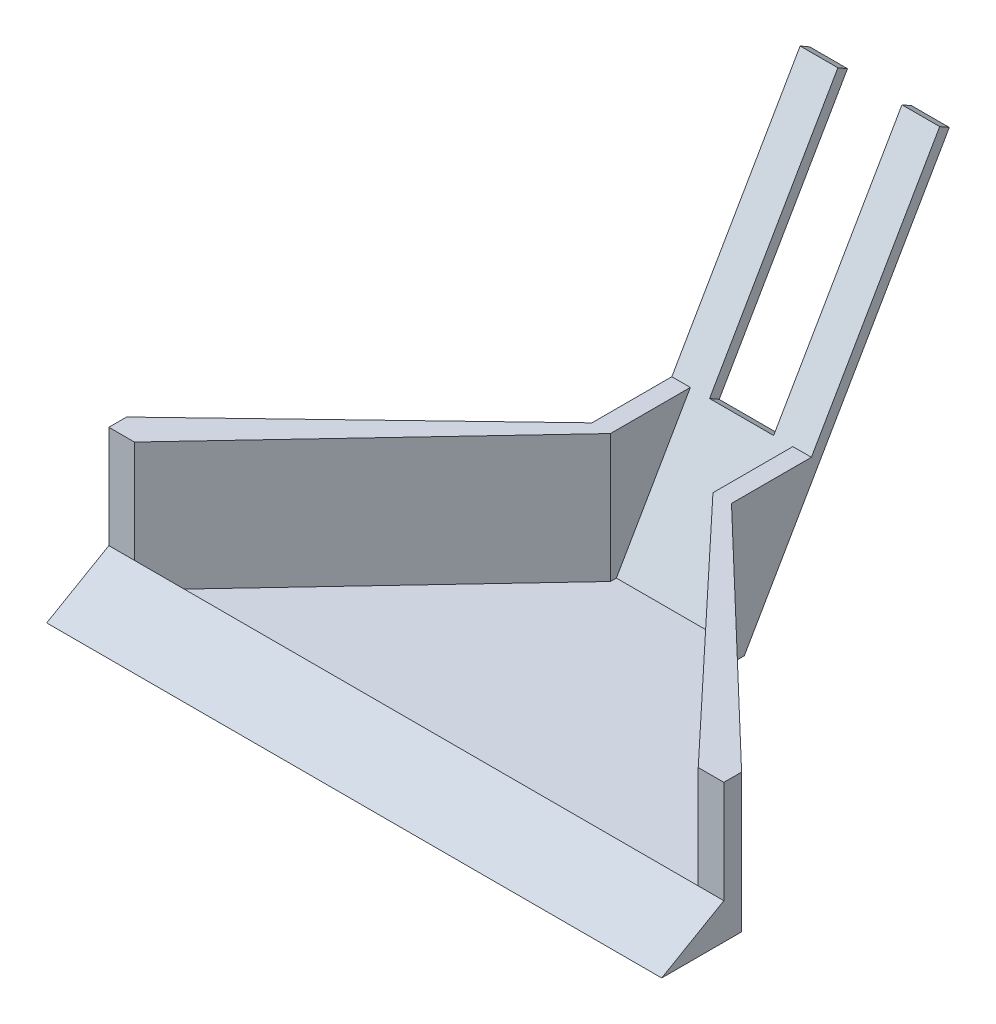
ISO-10303-21;
HEADER;
FILE_DESCRIPTION(('STEP AP214'),'2;1');
FILE_NAME('part.step','',(''),(''),'','','');
FILE_SCHEMA(('AUTOMOTIVE_DESIGN { 1 0 10303 214 1 1 1 1 }'));
ENDSEC;
DATA;
#1=APPLICATION_CONTEXT('core data for automotive mechanical design processes');
#2=APPLICATION_PROTOCOL_DEFINITION('international standard','automotive_design',2000,#1);
#3=PRODUCT_CONTEXT('',#1,'mechanical');
#4=PRODUCT('Part','Part','',(#3));
#5=PRODUCT_RELATED_PRODUCT_CATEGORY('part','',(#4));
#6=PRODUCT_DEFINITION_FORMATION('','',#4);
#7=PRODUCT_DEFINITION_CONTEXT('part definition',#1,'design');
#8=PRODUCT_DEFINITION('design','',#6,#7);
#9=PRODUCT_DEFINITION_SHAPE('','',#8);
#10=(LENGTH_UNIT() NAMED_UNIT(*) SI_UNIT(.MILLI.,.METRE.));
#11=(NAMED_UNIT(*) PLANE_ANGLE_UNIT() SI_UNIT($,.RADIAN.));
#12=(NAMED_UNIT(*) SI_UNIT($,.STERADIAN.) SOLID_ANGLE_UNIT());
#13=UNCERTAINTY_MEASURE_WITH_UNIT(LENGTH_MEASURE(1.E-05),#10,'distance_accuracy_value','');
#14=(GEOMETRIC_REPRESENTATION_CONTEXT(3) GLOBAL_UNCERTAINTY_ASSIGNED_CONTEXT((#13)) GLOBAL_UNIT_ASSIGNED_CONTEXT((#10,
#11,#12)) REPRESENTATION_CONTEXT('',''));
#15=CARTESIAN_POINT('',(0.,0.,0.));
#16=DIRECTION('',(0.,0.,1.));
#17=DIRECTION('',(1.,0.,0.));
#18=AXIS2_PLACEMENT_3D('',#15,#16,#17);
#19=CARTESIAN_POINT('',(0.,0.,152.4));
#20=DIRECTION('',(0.,1.,0.));
#21=DIRECTION('',(0.,0.,1.));
#22=AXIS2_PLACEMENT_3D('',#19,#20,#21);
#23=PLANE('',#22);
#24=DIRECTION('',(1.,0.,0.));
#25=VECTOR('',#24,1.);
#26=CARTESIAN_POINT('',(117.8183443338,0.,-6.35000000000004));
#27=LINE('',#26,#25);
#28=CARTESIAN_POINT('',(117.8183443338,0.,-6.35000000000001));
#29=VERTEX_POINT('',#28);
#30=CARTESIAN_POINT('',(186.9816556662,0.,-6.35));
#31=VERTEX_POINT('',#30);
#32=EDGE_CURVE('E212',#29,#31,#27,.T.);
#33=ORIENTED_EDGE('',*,*,#32,.T.);
#34=DIRECTION('',(0.,0.,1.));
#35=VECTOR('',#34,1.);
#36=CARTESIAN_POINT('',(186.9816556662,0.,-76.2));
#37=LINE('',#36,#35);
#38=CARTESIAN_POINT('',(186.9816556662,0.,0.));
#39=VERTEX_POINT('',#38);
#40=EDGE_CURVE('E233',#31,#39,#37,.T.);
#41=ORIENTED_EDGE('',*,*,#40,.T.);
#42=DIRECTION('',(0.72228416861206,0.,0.69159639947905));
#43=VECTOR('',#42,1.);
#44=CARTESIAN_POINT('',(165.562608695136,0.,-20.5090135007743));
#45=LINE('',#44,#43);
#46=CARTESIAN_POINT('',(304.8,0.,112.81258301759));
#47=VERTEX_POINT('',#46);
#48=EDGE_CURVE('E286',#39,#47,#45,.T.);
#49=ORIENTED_EDGE('',*,*,#48,.T.);
#50=DIRECTION('',(0.,0.,-1.));
#51=VECTOR('',#50,1.);
#52=CARTESIAN_POINT('',(304.8,0.,152.4));
#53=LINE('',#52,#51);
#54=CARTESIAN_POINT('',(304.8,0.,152.4));
#55=VERTEX_POINT('',#54);
#56=EDGE_CURVE('E313',#55,#47,#53,.T.);
#57=ORIENTED_EDGE('',*,*,#56,.F.);
#58=DIRECTION('',(1.,0.,0.));
#59=VECTOR('',#58,1.);
#60=CARTESIAN_POINT('',(0.,0.,152.4));
#61=LINE('',#60,#59);
#62=CARTESIAN_POINT('',(0.,0.,152.4));
#63=VERTEX_POINT('',#62);
#64=EDGE_CURVE('E310',#63,#55,#61,.T.);
#65=ORIENTED_EDGE('',*,*,#64,.F.);
#66=DIRECTION('',(0.,0.,-1.));
#67=VECTOR('',#66,1.);
#68=CARTESIAN_POINT('',(0.,0.,152.4));
#69=LINE('',#68,#67);
#70=CARTESIAN_POINT('',(0.,0.,112.812583017591));
#71=VERTEX_POINT('',#70);
#72=EDGE_CURVE('E316',#63,#71,#69,.T.);
#73=ORIENTED_EDGE('',*,*,#72,.T.);
#74=DIRECTION('',(0.72228416861206,0.,-0.69159639947905));
#75=VECTOR('',#74,1.);
#76=CARTESIAN_POINT('',(-19.7750679805127,0.,131.747465449053));
#77=LINE('',#76,#75);
#78=CARTESIAN_POINT('',(117.8183443338,0.,0.));
#79=VERTEX_POINT('',#78);
#80=EDGE_CURVE('E295',#71,#79,#77,.T.);
#81=ORIENTED_EDGE('',*,*,#80,.T.);
#82=DIRECTION('',(0.,0.,1.));
#83=VECTOR('',#82,1.);
#84=CARTESIAN_POINT('',(117.8183443338,0.,-76.2));
#85=LINE('',#84,#83);
#86=EDGE_CURVE('E231',#29,#79,#85,.T.);
#87=ORIENTED_EDGE('',*,*,#86,.F.);
#88=EDGE_LOOP('',(#33,#41,#49,#57,#65,#73,#81,#87));
#89=FACE_BOUND('',#88,.T.);
#90=ADVANCED_FACE('F32',(#89),#23,.F.);
#91=CARTESIAN_POINT('',(186.9816556662,68.58,-76.2));
#92=DIRECTION('',(-1.,0.,0.));
#93=DIRECTION('',(0.,-1.,0.));
#94=AXIS2_PLACEMENT_3D('',#91,#92,#93);
#95=PLANE('',#94);
#96=DIRECTION('',(0.,0.866025403784436,-0.500000000000004));
#97=VECTOR('',#96,1.);
#98=CARTESIAN_POINT('',(186.9816556662,0.,-6.35000000000002));
#99=LINE('',#98,#97);
#100=CARTESIAN_POINT('',(186.981655666199,175.976362048997,-107.950000000001));
#101=VERTEX_POINT('',#100);
#102=EDGE_CURVE('E206',#31,#101,#99,.T.);
#103=ORIENTED_EDGE('',*,*,#102,.T.);
#104=DIRECTION('',(0.,0.500000000000004,0.866025403784436));
#105=VECTOR('',#104,1.);
#106=CARTESIAN_POINT('',(186.981655666199,172.375992706013,-114.186022628063));
#107=LINE('',#106,#105);
#108=CARTESIAN_POINT('',(186.981655666199,178.725992706013,-103.187500000001));
#109=VERTEX_POINT('',#108);
#110=EDGE_CURVE('E185',#101,#109,#107,.T.);
#111=ORIENTED_EDGE('',*,*,#110,.T.);
#112=DIRECTION('',(0.,-0.866025403784436,0.500000000000004));
#113=VECTOR('',#112,1.);
#114=CARTESIAN_POINT('',(186.9816556662,-2.26500636110826E-13,0.));
#115=LINE('',#114,#113);
#116=CARTESIAN_POINT('',(186.981655666199,68.58,-39.5946814610251));
#117=VERTEX_POINT('',#116);
#118=EDGE_CURVE('E210',#109,#117,#115,.T.);
#119=ORIENTED_EDGE('',*,*,#118,.T.);
#120=DIRECTION('',(0.,0.,1.));
#121=VECTOR('',#120,1.);
#122=CARTESIAN_POINT('',(186.9816556662,68.58,-76.2));
#123=LINE('',#122,#121);
#124=CARTESIAN_POINT('',(186.9816556662,68.58,0.));
#125=VERTEX_POINT('',#124);
#126=EDGE_CURVE('E235',#117,#125,#123,.T.);
#127=ORIENTED_EDGE('',*,*,#126,.T.);
#128=DIRECTION('',(0.,1.,0.));
#129=VECTOR('',#128,1.);
#130=CARTESIAN_POINT('',(186.9816556662,-198.12,0.));
#131=LINE('',#130,#129);
#132=EDGE_CURVE('E283',#39,#125,#131,.T.);
#133=ORIENTED_EDGE('',*,*,#132,.F.);
#134=ORIENTED_EDGE('',*,*,#40,.F.);
#135=EDGE_LOOP('',(#103,#111,#119,#127,#133,#134));
#136=FACE_BOUND('',#135,.T.);
#137=ADVANCED_FACE('F357',(#136),#95,.F.);
#138=CARTESIAN_POINT('',(117.8183443338,0.,-76.2));
#139=DIRECTION('',(1.,0.,0.));
#140=DIRECTION('',(0.,0.,-1.));
#141=AXIS2_PLACEMENT_3D('',#138,#139,#140);
#142=PLANE('',#141);
#143=DIRECTION('',(0.,0.866025403784437,-0.500000000000004));
#144=VECTOR('',#143,1.);
#145=CARTESIAN_POINT('',(117.8183443338,-3.32572689780004E-13,0.));
#146=LINE('',#145,#144);
#147=CARTESIAN_POINT('',(117.8183443338,68.58,-39.5946814610251));
#148=VERTEX_POINT('',#147);
#149=CARTESIAN_POINT('',(117.8183443338,178.725992706013,-103.187500000001));
#150=VERTEX_POINT('',#149);
#151=EDGE_CURVE('E190',#148,#150,#146,.T.);
#152=ORIENTED_EDGE('',*,*,#151,.T.);
#153=DIRECTION('',(0.,0.500000000000004,0.866025403784436));
#154=VECTOR('',#153,1.);
#155=CARTESIAN_POINT('',(117.8183443338,172.375992706013,-114.186022628063));
#156=LINE('',#155,#154);
#157=CARTESIAN_POINT('',(117.8183443338,175.976362048997,-107.950000000001));
#158=VERTEX_POINT('',#157);
#159=EDGE_CURVE('E178',#158,#150,#156,.T.);
#160=ORIENTED_EDGE('',*,*,#159,.F.);
#161=DIRECTION('',(0.,-0.866025403784436,0.500000000000004));
#162=VECTOR('',#161,1.);
#163=CARTESIAN_POINT('',(117.8183443338,-1.06072053669178E-13,-6.34999999999998));
#164=LINE('',#163,#162);
#165=EDGE_CURVE('E201',#158,#29,#164,.T.);
#166=ORIENTED_EDGE('',*,*,#165,.T.);
#167=ORIENTED_EDGE('',*,*,#86,.T.);
#168=DIRECTION('',(0.,1.,0.));
#169=VECTOR('',#168,1.);
#170=CARTESIAN_POINT('',(117.8183443338,-198.12,0.));
#171=LINE('',#170,#169);
#172=CARTESIAN_POINT('',(117.8183443338,68.58,0.));
#173=VERTEX_POINT('',#172);
#174=EDGE_CURVE('E284',#79,#173,#171,.T.);
#175=ORIENTED_EDGE('',*,*,#174,.T.);
#176=DIRECTION('',(0.,0.,1.));
#177=VECTOR('',#176,1.);
#178=CARTESIAN_POINT('',(117.8183443338,68.58,-76.2));
#179=LINE('',#178,#177);
#180=EDGE_CURVE('E199',#148,#173,#179,.T.);
#181=ORIENTED_EDGE('',*,*,#180,.F.);
#182=EDGE_LOOP('',(#152,#160,#166,#167,#175,#181));
#183=FACE_BOUND('',#182,.T.);
#184=ADVANCED_FACE('F197',(#183),#142,.F.);
#185=CARTESIAN_POINT('',(0.,5.08,0.));
#186=DIRECTION('',(0.,-1.,0.));
#187=DIRECTION('',(0.,0.,-1.));
#188=AXIS2_PLACEMENT_3D('',#185,#186,#187);
#189=PLANE('',#188);
#190=DIRECTION('',(0.,0.,1.));
#191=VECTOR('',#190,1.);
#192=CARTESIAN_POINT('',(177.8,5.08,-76.2));
#193=LINE('',#192,#191);
#194=CARTESIAN_POINT('',(177.8,5.08,-2.93293936748345));
#195=VERTEX_POINT('',#194);
#196=CARTESIAN_POINT('',(177.8,5.08,0.));
#197=VERTEX_POINT('',#196);
#198=EDGE_CURVE('E224',#195,#197,#193,.T.);
#199=ORIENTED_EDGE('',*,*,#198,.F.);
#200=DIRECTION('',(-1.,0.,0.));
#201=VECTOR('',#200,1.);
#202=CARTESIAN_POINT('',(0.,5.08,-2.93293936748349));
#203=LINE('',#202,#201);
#204=CARTESIAN_POINT('',(127.,5.08,-2.93293936748346));
#205=VERTEX_POINT('',#204);
#206=EDGE_CURVE('E204',#195,#205,#203,.T.);
#207=ORIENTED_EDGE('',*,*,#206,.T.);
#208=DIRECTION('',(0.,0.,1.));
#209=VECTOR('',#208,1.);
#210=CARTESIAN_POINT('',(127.,5.08,-76.2));
#211=LINE('',#210,#209);
#212=CARTESIAN_POINT('',(127.,5.08,0.));
#213=VERTEX_POINT('',#212);
#214=EDGE_CURVE('E226',#205,#213,#211,.T.);
#215=ORIENTED_EDGE('',*,*,#214,.T.);
#216=DIRECTION('',(0.684884914125776,0.,-0.728651257051635));
#217=VECTOR('',#216,1.);
#218=CARTESIAN_POINT('',(127.,5.08,0.));
#219=LINE('',#218,#217);
#220=CARTESIAN_POINT('',(12.7,5.08,121.604136641425));
#221=VERTEX_POINT('',#220);
#222=EDGE_CURVE('E260',#221,#213,#219,.T.);
#223=ORIENTED_EDGE('',*,*,#222,.F.);
#224=DIRECTION('',(1.,0.,0.));
#225=VECTOR('',#224,1.);
#226=CARTESIAN_POINT('',(0.,5.08,121.604136641425));
#227=LINE('',#226,#225);
#228=CARTESIAN_POINT('',(292.1,5.08,121.604136641425));
#229=VERTEX_POINT('',#228);
#230=EDGE_CURVE('E298',#221,#229,#227,.T.);
#231=ORIENTED_EDGE('',*,*,#230,.T.);
#232=DIRECTION('',(0.684884914125776,0.,0.728651257051635));
#233=VECTOR('',#232,1.);
#234=CARTESIAN_POINT('',(177.8,5.08,0.));
#235=LINE('',#234,#233);
#236=EDGE_CURVE('E237',#197,#229,#235,.T.);
#237=ORIENTED_EDGE('',*,*,#236,.F.);
#238=EDGE_LOOP('',(#199,#207,#215,#223,#231,#237));
#239=FACE_BOUND('',#238,.T.);
#240=ADVANCED_FACE('F426',(#239),#189,.F.);
#241=CARTESIAN_POINT('',(0.,68.58,0.));
#242=DIRECTION('',(0.,-1.,0.));
#243=DIRECTION('',(0.,0.,-1.));
#244=AXIS2_PLACEMENT_3D('',#241,#242,#243);
#245=PLANE('',#244);
#246=DIRECTION('',(0.,0.,1.));
#247=VECTOR('',#246,1.);
#248=CARTESIAN_POINT('',(127.,68.58,-76.2));
#249=LINE('',#248,#247);
#250=CARTESIAN_POINT('',(127.,68.58,-39.594681461025));
#251=VERTEX_POINT('',#250);
#252=CARTESIAN_POINT('',(127.,68.58,0.));
#253=VERTEX_POINT('',#252);
#254=EDGE_CURVE('E228',#251,#253,#249,.T.);
#255=ORIENTED_EDGE('',*,*,#254,.F.);
#256=DIRECTION('',(-1.,0.,0.));
#257=VECTOR('',#256,1.);
#258=CARTESIAN_POINT('',(0.,68.58,-39.5946814610251));
#259=LINE('',#258,#257);
#260=EDGE_CURVE('E220',#251,#148,#259,.T.);
#261=ORIENTED_EDGE('',*,*,#260,.T.);
#262=ORIENTED_EDGE('',*,*,#180,.T.);
#263=DIRECTION('',(-0.72228416861206,0.,0.69159639947905));
#264=VECTOR('',#263,1.);
#265=CARTESIAN_POINT('',(117.8183443338,68.58,0.));
#266=LINE('',#265,#264);
#267=CARTESIAN_POINT('',(0.,68.58,112.81258301759));
#268=VERTEX_POINT('',#267);
#269=EDGE_CURVE('E267',#173,#268,#266,.T.);
#270=ORIENTED_EDGE('',*,*,#269,.T.);
#271=DIRECTION('',(0.,0.,1.));
#272=VECTOR('',#271,1.);
#273=CARTESIAN_POINT('',(0.,68.58,112.81258301759));
#274=LINE('',#273,#272);
#275=CARTESIAN_POINT('',(0.,68.58,121.604136641425));
#276=VERTEX_POINT('',#275);
#277=EDGE_CURVE('E270',#268,#276,#274,.T.);
#278=ORIENTED_EDGE('',*,*,#277,.T.);
#279=DIRECTION('',(1.,0.,0.));
#280=VECTOR('',#279,1.);
#281=CARTESIAN_POINT('',(0.,68.58,121.604136641425));
#282=LINE('',#281,#280);
#283=CARTESIAN_POINT('',(12.7,68.58,121.604136641425));
#284=VERTEX_POINT('',#283);
#285=EDGE_CURVE('E261',#276,#284,#282,.T.);
#286=ORIENTED_EDGE('',*,*,#285,.T.);
#287=DIRECTION('',(0.684884914125776,0.,-0.728651257051635));
#288=VECTOR('',#287,1.);
#289=CARTESIAN_POINT('',(127.,68.58,0.));
#290=LINE('',#289,#288);
#291=EDGE_CURVE('E264',#284,#253,#290,.T.);
#292=ORIENTED_EDGE('',*,*,#291,.T.);
#293=EDGE_LOOP('',(#255,#261,#262,#270,#278,#286,#292));
#294=FACE_BOUND('',#293,.T.);
#295=ADVANCED_FACE('F396',(#294),#245,.F.);
#296=CARTESIAN_POINT('',(0.,68.58,0.));
#297=DIRECTION('',(0.,1.,0.));
#298=DIRECTION('',(0.,0.,1.));
#299=AXIS2_PLACEMENT_3D('',#296,#297,#298);
#300=PLANE('',#299);
#301=DIRECTION('',(1.,0.,0.));
#302=VECTOR('',#301,1.);
#303=CARTESIAN_POINT('',(0.,68.58,-39.5946814610251));
#304=LINE('',#303,#302);
#305=CARTESIAN_POINT('',(177.8,68.58,-39.594681461025));
#306=VERTEX_POINT('',#305);
#307=EDGE_CURVE('E200',#306,#117,#304,.T.);
#308=ORIENTED_EDGE('',*,*,#307,.F.);
#309=DIRECTION('',(0.,0.,1.));
#310=VECTOR('',#309,1.);
#311=CARTESIAN_POINT('',(177.8,68.58,-76.2));
#312=LINE('',#311,#310);
#313=CARTESIAN_POINT('',(177.8,68.58,0.));
#314=VERTEX_POINT('',#313);
#315=EDGE_CURVE('E222',#306,#314,#312,.T.);
#316=ORIENTED_EDGE('',*,*,#315,.T.);
#317=DIRECTION('',(0.684884914125776,0.,0.728651257051635));
#318=VECTOR('',#317,1.);
#319=CARTESIAN_POINT('',(177.8,68.58,0.));
#320=LINE('',#319,#318);
#321=CARTESIAN_POINT('',(292.1,68.58,121.604136641425));
#322=VERTEX_POINT('',#321);
#323=EDGE_CURVE('E238',#314,#322,#320,.T.);
#324=ORIENTED_EDGE('',*,*,#323,.T.);
#325=DIRECTION('',(1.,0.,0.));
#326=VECTOR('',#325,1.);
#327=CARTESIAN_POINT('',(292.1,68.58,121.604136641425));
#328=LINE('',#327,#326);
#329=CARTESIAN_POINT('',(304.8,68.58,121.604136641426));
#330=VERTEX_POINT('',#329);
#331=EDGE_CURVE('E241',#322,#330,#328,.T.);
#332=ORIENTED_EDGE('',*,*,#331,.T.);
#333=DIRECTION('',(0.,0.,-1.));
#334=VECTOR('',#333,1.);
#335=CARTESIAN_POINT('',(304.8,68.58,112.81258301759));
#336=LINE('',#335,#334);
#337=CARTESIAN_POINT('',(304.8,68.58,112.81258301759));
#338=VERTEX_POINT('',#337);
#339=EDGE_CURVE('E243',#330,#338,#336,.T.);
#340=ORIENTED_EDGE('',*,*,#339,.T.);
#341=DIRECTION('',(-0.72228416861206,0.,-0.69159639947905));
#342=VECTOR('',#341,1.);
#343=CARTESIAN_POINT('',(186.9816556662,68.58,0.));
#344=LINE('',#343,#342);
#345=EDGE_CURVE('E246',#338,#125,#344,.T.);
#346=ORIENTED_EDGE('',*,*,#345,.T.);
#347=ORIENTED_EDGE('',*,*,#126,.F.);
#348=EDGE_LOOP('',(#308,#316,#324,#332,#340,#346,#347));
#349=FACE_BOUND('',#348,.T.);
#350=ADVANCED_FACE('F365',(#349),#300,.T.);
#351=CARTESIAN_POINT('',(127.,5.08,-76.2));
#352=DIRECTION('',(-1.,0.,0.));
#353=DIRECTION('',(0.,0.,1.));
#354=AXIS2_PLACEMENT_3D('',#351,#352,#353);
#355=PLANE('',#354);
#356=ORIENTED_EDGE('',*,*,#214,.F.);
#357=DIRECTION('',(0.,0.866025403784437,-0.500000000000004));
#358=VECTOR('',#357,1.);
#359=CARTESIAN_POINT('',(127.,36.8055678841872,-21.2497045256129));
#360=LINE('',#359,#358);
#361=EDGE_CURVE('E217',#205,#251,#360,.T.);
#362=ORIENTED_EDGE('',*,*,#361,.T.);
#363=ORIENTED_EDGE('',*,*,#254,.T.);
#364=DIRECTION('',(0.,-1.,0.));
#365=VECTOR('',#364,1.);
#366=CARTESIAN_POINT('',(127.,68.58,0.));
#367=LINE('',#366,#365);
#368=EDGE_CURVE('E276',#253,#213,#367,.T.);
#369=ORIENTED_EDGE('',*,*,#368,.T.);
#370=EDGE_LOOP('',(#356,#362,#363,#369));
#371=FACE_BOUND('',#370,.T.);
#372=ADVANCED_FACE('F453',(#371),#355,.F.);
#373=CARTESIAN_POINT('',(177.8,68.58,-76.2));
#374=DIRECTION('',(1.,0.,0.));
#375=DIRECTION('',(0.,0.,-1.));
#376=AXIS2_PLACEMENT_3D('',#373,#374,#375);
#377=PLANE('',#376);
#378=ORIENTED_EDGE('',*,*,#315,.F.);
#379=DIRECTION('',(0.,-0.866025403784437,0.500000000000004));
#380=VECTOR('',#379,1.);
#381=CARTESIAN_POINT('',(177.8,84.430567884187,-48.7460110957689));
#382=LINE('',#381,#380);
#383=EDGE_CURVE('E319',#306,#195,#382,.T.);
#384=ORIENTED_EDGE('',*,*,#383,.T.);
#385=ORIENTED_EDGE('',*,*,#198,.T.);
#386=DIRECTION('',(0.,-1.,0.));
#387=VECTOR('',#386,1.);
#388=CARTESIAN_POINT('',(177.8,68.58,0.));
#389=LINE('',#388,#387);
#390=EDGE_CURVE('E249',#314,#197,#389,.T.);
#391=ORIENTED_EDGE('',*,*,#390,.F.);
#392=EDGE_LOOP('',(#378,#384,#385,#391));
#393=FACE_BOUND('',#392,.T.);
#394=ADVANCED_FACE('F424',(#393),#377,.F.);
#395=CARTESIAN_POINT('',(0.,-1.32881606682061E-13,121.604136641425));
#396=DIRECTION('',(0.,0.,1.));
#397=DIRECTION('',(0.,-1.,0.));
#398=AXIS2_PLACEMENT_3D('',#395,#396,#397);
#399=PLANE('',#398);
#400=DIRECTION('',(0.,-1.,0.));
#401=VECTOR('',#400,1.);
#402=CARTESIAN_POINT('',(292.1,68.58,121.604136641425));
#403=LINE('',#402,#401);
#404=CARTESIAN_POINT('',(292.1,17.78,121.604136641425));
#405=VERTEX_POINT('',#404);
#406=EDGE_CURVE('E256',#405,#229,#403,.T.);
#407=ORIENTED_EDGE('',*,*,#406,.T.);
#408=ORIENTED_EDGE('',*,*,#230,.F.);
#409=DIRECTION('',(0.,-1.,0.));
#410=VECTOR('',#409,1.);
#411=CARTESIAN_POINT('',(12.7,68.58,121.604136641425));
#412=LINE('',#411,#410);
#413=CARTESIAN_POINT('',(12.7,17.78,121.604136641425));
#414=VERTEX_POINT('',#413);
#415=EDGE_CURVE('E279',#414,#221,#412,.T.);
#416=ORIENTED_EDGE('',*,*,#415,.F.);
#417=DIRECTION('',(1.,0.,0.));
#418=VECTOR('',#417,1.);
#419=CARTESIAN_POINT('',(0.,17.78,121.604136641426));
#420=LINE('',#419,#418);
#421=EDGE_CURVE('E311',#414,#405,#420,.T.);
#422=ORIENTED_EDGE('',*,*,#421,.T.);
#423=EDGE_LOOP('',(#407,#408,#416,#422));
#424=FACE_BOUND('',#423,.T.);
#425=ADVANCED_FACE('F421',(#424),#399,.F.);
#426=CARTESIAN_POINT('',(0.,0.,152.4));
#427=DIRECTION('',(1.,0.,0.));
#428=DIRECTION('',(0.,0.,-1.));
#429=AXIS2_PLACEMENT_3D('',#426,#427,#428);
#430=PLANE('',#429);
#431=DIRECTION('',(0.,0.500000000000002,-0.866025403784438));
#432=VECTOR('',#431,1.);
#433=CARTESIAN_POINT('',(0.,65.9911357683744,38.1000000000002));
#434=LINE('',#433,#432);
#435=CARTESIAN_POINT('',(0.,17.78,121.604136641425));
#436=VERTEX_POINT('',#435);
#437=EDGE_CURVE('E302',#63,#436,#434,.T.);
#438=ORIENTED_EDGE('',*,*,#437,.T.);
#439=DIRECTION('',(0.,-1.,0.));
#440=VECTOR('',#439,1.);
#441=CARTESIAN_POINT('',(0.,68.58,121.604136641425));
#442=LINE('',#441,#440);
#443=EDGE_CURVE('E272',#276,#436,#442,.T.);
#444=ORIENTED_EDGE('',*,*,#443,.F.);
#445=ORIENTED_EDGE('',*,*,#277,.F.);
#446=DIRECTION('',(0.,1.,0.));
#447=VECTOR('',#446,1.);
#448=CARTESIAN_POINT('',(0.,-198.12,112.812583017591));
#449=LINE('',#448,#447);
#450=EDGE_CURVE('E287',#71,#268,#449,.T.);
#451=ORIENTED_EDGE('',*,*,#450,.F.);
#452=ORIENTED_EDGE('',*,*,#72,.F.);
#453=EDGE_LOOP('',(#438,#444,#445,#451,#452));
#454=FACE_BOUND('',#453,.T.);
#455=ADVANCED_FACE('F34',(#454),#430,.F.);
#456=CARTESIAN_POINT('',(304.8,0.,152.4));
#457=DIRECTION('',(-1.,0.,0.));
#458=DIRECTION('',(0.,0.,1.));
#459=AXIS2_PLACEMENT_3D('',#456,#457,#458);
#460=PLANE('',#459);
#461=ORIENTED_EDGE('',*,*,#56,.T.);
#462=DIRECTION('',(0.,1.,0.));
#463=VECTOR('',#462,1.);
#464=CARTESIAN_POINT('',(304.8,-198.12,112.81258301759));
#465=LINE('',#464,#463);
#466=EDGE_CURVE('E289',#47,#338,#465,.T.);
#467=ORIENTED_EDGE('',*,*,#466,.T.);
#468=ORIENTED_EDGE('',*,*,#339,.F.);
#469=DIRECTION('',(0.,-1.,0.));
#470=VECTOR('',#469,1.);
#471=CARTESIAN_POINT('',(304.8,68.58,121.604136641426));
#472=LINE('',#471,#470);
#473=CARTESIAN_POINT('',(304.8,17.78,121.604136641426));
#474=VERTEX_POINT('',#473);
#475=EDGE_CURVE('E253',#330,#474,#472,.T.);
#476=ORIENTED_EDGE('',*,*,#475,.T.);
#477=DIRECTION('',(0.,0.500000000000002,-0.866025403784438));
#478=VECTOR('',#477,1.);
#479=CARTESIAN_POINT('',(304.8,65.9911357683744,38.1000000000002));
#480=LINE('',#479,#478);
#481=EDGE_CURVE('E301',#55,#474,#480,.T.);
#482=ORIENTED_EDGE('',*,*,#481,.F.);
#483=EDGE_LOOP('',(#461,#467,#468,#476,#482));
#484=FACE_BOUND('',#483,.T.);
#485=ADVANCED_FACE('F376',(#484),#460,.F.);
#486=CARTESIAN_POINT('',(0.,65.9911357683744,38.1000000000002));
#487=DIRECTION('',(0.,-0.866025403784438,-0.500000000000001));
#488=DIRECTION('',(0.,0.500000000000001,-0.866025403784438));
#489=AXIS2_PLACEMENT_3D('',#486,#487,#488);
#490=PLANE('',#489);
#491=ORIENTED_EDGE('',*,*,#481,.T.);
#492=EDGE_CURVE('E305',#405,#474,#420,.T.);
#493=ORIENTED_EDGE('',*,*,#492,.F.);
#494=ORIENTED_EDGE('',*,*,#421,.F.);
#495=EDGE_CURVE('E308',#436,#414,#420,.T.);
#496=ORIENTED_EDGE('',*,*,#495,.F.);
#497=ORIENTED_EDGE('',*,*,#437,.F.);
#498=ORIENTED_EDGE('',*,*,#64,.T.);
#499=EDGE_LOOP('',(#491,#493,#494,#496,#497,#498));
#500=FACE_BOUND('',#499,.T.);
#501=ADVANCED_FACE('F381',(#500),#490,.F.);
#502=CARTESIAN_POINT('',(89.4343692202221,-198.12,-93.4027838580859));
#503=DIRECTION('',(-0.69159639947905,0.,0.72228416861206));
#504=DIRECTION('',(0.72228416861206,0.,0.69159639947905));
#505=AXIS2_PLACEMENT_3D('',#502,#503,#504);
#506=PLANE('',#505);
#507=ORIENTED_EDGE('',*,*,#132,.T.);
#508=ORIENTED_EDGE('',*,*,#345,.F.);
#509=ORIENTED_EDGE('',*,*,#466,.F.);
#510=ORIENTED_EDGE('',*,*,#48,.F.);
#511=EDGE_LOOP('',(#507,#508,#509,#510));
#512=FACE_BOUND('',#511,.T.);
#513=ADVANCED_FACE('F370',(#512),#506,.F.);
#514=CARTESIAN_POINT('',(56.353171494401,-198.12,58.8536950917415));
#515=DIRECTION('',(0.69159639947905,0.,0.72228416861206));
#516=DIRECTION('',(0.72228416861206,0.,-0.69159639947905));
#517=AXIS2_PLACEMENT_3D('',#514,#515,#516);
#518=PLANE('',#517);
#519=ORIENTED_EDGE('',*,*,#450,.T.);
#520=ORIENTED_EDGE('',*,*,#269,.F.);
#521=ORIENTED_EDGE('',*,*,#174,.F.);
#522=ORIENTED_EDGE('',*,*,#80,.F.);
#523=EDGE_LOOP('',(#519,#520,#521,#522));
#524=FACE_BOUND('',#523,.T.);
#525=ADVANCED_FACE('F392',(#524),#518,.F.);
#526=CARTESIAN_POINT('',(0.,68.58,121.604136641425));
#527=DIRECTION('',(0.,0.,-1.));
#528=DIRECTION('',(-1.,0.,0.));
#529=AXIS2_PLACEMENT_3D('',#526,#527,#528);
#530=PLANE('',#529);
#531=ORIENTED_EDGE('',*,*,#443,.T.);
#532=ORIENTED_EDGE('',*,*,#495,.T.);
#533=EDGE_CURVE('E280',#284,#414,#412,.T.);
#534=ORIENTED_EDGE('',*,*,#533,.F.);
#535=ORIENTED_EDGE('',*,*,#285,.F.);
#536=EDGE_LOOP('',(#531,#532,#534,#535));
#537=FACE_BOUND('',#536,.T.);
#538=ADVANCED_FACE('F434',(#537),#530,.F.);
#539=CARTESIAN_POINT('',(127.,68.58,0.));
#540=DIRECTION('',(-0.728651257051635,0.,-0.684884914125776));
#541=DIRECTION('',(-0.684884914125777,0.,0.728651257051635));
#542=AXIS2_PLACEMENT_3D('',#539,#540,#541);
#543=PLANE('',#542);
#544=ORIENTED_EDGE('',*,*,#222,.T.);
#545=ORIENTED_EDGE('',*,*,#368,.F.);
#546=ORIENTED_EDGE('',*,*,#291,.F.);
#547=ORIENTED_EDGE('',*,*,#533,.T.);
#548=ORIENTED_EDGE('',*,*,#415,.T.);
#549=EDGE_LOOP('',(#544,#545,#546,#547,#548));
#550=FACE_BOUND('',#549,.T.);
#551=ADVANCED_FACE('F437',(#550),#543,.F.);
#552=CARTESIAN_POINT('',(292.1,68.58,121.604136641425));
#553=DIRECTION('',(0.,0.,-1.));
#554=DIRECTION('',(-1.,0.,0.));
#555=AXIS2_PLACEMENT_3D('',#552,#553,#554);
#556=PLANE('',#555);
#557=EDGE_CURVE('E257',#322,#405,#403,.T.);
#558=ORIENTED_EDGE('',*,*,#557,.T.);
#559=ORIENTED_EDGE('',*,*,#492,.T.);
#560=ORIENTED_EDGE('',*,*,#475,.F.);
#561=ORIENTED_EDGE('',*,*,#331,.F.);
#562=EDGE_LOOP('',(#558,#559,#560,#561));
#563=FACE_BOUND('',#562,.T.);
#564=ADVANCED_FACE('F441',(#563),#556,.F.);
#565=CARTESIAN_POINT('',(177.8,68.58,0.));
#566=DIRECTION('',(0.728651257051635,0.,-0.684884914125776));
#567=DIRECTION('',(-0.684884914125777,0.,-0.728651257051635));
#568=AXIS2_PLACEMENT_3D('',#565,#566,#567);
#569=PLANE('',#568);
#570=ORIENTED_EDGE('',*,*,#236,.T.);
#571=ORIENTED_EDGE('',*,*,#406,.F.);
#572=ORIENTED_EDGE('',*,*,#557,.F.);
#573=ORIENTED_EDGE('',*,*,#323,.F.);
#574=ORIENTED_EDGE('',*,*,#390,.T.);
#575=EDGE_LOOP('',(#570,#571,#572,#573,#574));
#576=FACE_BOUND('',#575,.T.);
#577=ADVANCED_FACE('F445',(#576),#569,.F.);
#578=CARTESIAN_POINT('',(-139.415445242919,-3.58599490222887E-13,0.));
#579=DIRECTION('',(0.,0.500000000000004,0.866025403784436));
#580=DIRECTION('',(0.,-0.866025403784437,0.500000000000004));
#581=AXIS2_PLACEMENT_3D('',#578,#579,#580);
#582=PLANE('',#581);
#583=DIRECTION('',(1.,0.,0.));
#584=VECTOR('',#583,1.);
#585=CARTESIAN_POINT('',(117.8183443338,178.725992706013,-103.187500000001));
#586=LINE('',#585,#584);
#587=CARTESIAN_POINT('',(136.525,178.725992706013,-103.187500000001));
#588=VERTEX_POINT('',#587);
#589=EDGE_CURVE('E47',#150,#588,#586,.T.);
#590=ORIENTED_EDGE('',*,*,#589,.F.);
#591=ORIENTED_EDGE('',*,*,#151,.F.);
#592=ORIENTED_EDGE('',*,*,#260,.F.);
#593=ORIENTED_EDGE('',*,*,#361,.F.);
#594=ORIENTED_EDGE('',*,*,#206,.F.);
#595=ORIENTED_EDGE('',*,*,#383,.F.);
#596=ORIENTED_EDGE('',*,*,#307,.T.);
#597=ORIENTED_EDGE('',*,*,#118,.F.);
#598=CARTESIAN_POINT('',(168.275,178.725992706013,-103.187500000001));
#599=VERTEX_POINT('',#598);
#600=EDGE_CURVE('E194',#599,#109,#586,.T.);
#601=ORIENTED_EDGE('',*,*,#600,.F.);
#602=DIRECTION('',(0.,0.866025403784436,-0.500000000000004));
#603=VECTOR('',#602,1.);
#604=CARTESIAN_POINT('',(168.275,68.5800000000001,-39.5946814610249));
#605=LINE('',#604,#603);
#606=CARTESIAN_POINT('',(168.275,68.5800000000001,-39.5946814610249));
#607=VERTEX_POINT('',#606);
#608=EDGE_CURVE('E337',#607,#599,#605,.T.);
#609=ORIENTED_EDGE('',*,*,#608,.F.);
#610=DIRECTION('',(1.,0.,0.));
#611=VECTOR('',#610,1.);
#612=CARTESIAN_POINT('',(136.525,68.5800000000001,-39.5946814610249));
#613=LINE('',#612,#611);
#614=CARTESIAN_POINT('',(136.525,68.5800000000001,-39.5946814610249));
#615=VERTEX_POINT('',#614);
#616=EDGE_CURVE('E348',#615,#607,#613,.T.);
#617=ORIENTED_EDGE('',*,*,#616,.F.);
#618=DIRECTION('',(0.,-0.866025403784436,0.500000000000004));
#619=VECTOR('',#618,1.);
#620=CARTESIAN_POINT('',(136.525,68.5800000000001,-39.5946814610249));
#621=LINE('',#620,#619);
#622=EDGE_CURVE('E193',#588,#615,#621,.T.);
#623=ORIENTED_EDGE('',*,*,#622,.F.);
#624=EDGE_LOOP('',(#590,#591,#592,#593,#594,#595,#596,#597,#601,#609,#617,#623));
#625=FACE_BOUND('',#624,.T.);
#626=ADVANCED_FACE('F189',(#625),#582,.T.);
#627=CARTESIAN_POINT('',(-139.415445242919,-1.3209885411206E-13,-6.35000000000002));
#628=DIRECTION('',(0.,-0.500000000000004,-0.866025403784436));
#629=DIRECTION('',(0.,0.866025403784436,-0.500000000000004));
#630=AXIS2_PLACEMENT_3D('',#627,#628,#629);
#631=PLANE('',#630);
#632=DIRECTION('',(-1.,0.,0.));
#633=VECTOR('',#632,1.);
#634=CARTESIAN_POINT('',(-139.415445242919,175.976362048997,-107.950000000001));
#635=LINE('',#634,#633);
#636=CARTESIAN_POINT('',(168.275,175.976362048998,-107.950000000001));
#637=VERTEX_POINT('',#636);
#638=EDGE_CURVE('E55',#101,#637,#635,.T.);
#639=ORIENTED_EDGE('',*,*,#638,.F.);
#640=ORIENTED_EDGE('',*,*,#102,.F.);
#641=ORIENTED_EDGE('',*,*,#32,.F.);
#642=ORIENTED_EDGE('',*,*,#165,.F.);
#643=CARTESIAN_POINT('',(136.525,175.976362048998,-107.950000000001));
#644=VERTEX_POINT('',#643);
#645=EDGE_CURVE('E181',#644,#158,#635,.T.);
#646=ORIENTED_EDGE('',*,*,#645,.F.);
#647=DIRECTION('',(0.,0.866025403784436,-0.500000000000004));
#648=VECTOR('',#647,1.);
#649=CARTESIAN_POINT('',(136.525,-1.04179322567331E-13,-6.34999999999997));
#650=LINE('',#649,#648);
#651=CARTESIAN_POINT('',(136.525,65.8303693429844,-44.357181461025));
#652=VERTEX_POINT('',#651);
#653=EDGE_CURVE('E336',#652,#644,#650,.T.);
#654=ORIENTED_EDGE('',*,*,#653,.F.);
#655=DIRECTION('',(-1.,0.,0.));
#656=VECTOR('',#655,1.);
#657=CARTESIAN_POINT('',(-139.415445242919,65.8303693429844,-44.357181461025));
#658=LINE('',#657,#656);
#659=CARTESIAN_POINT('',(168.275,65.8303693429844,-44.357181461025));
#660=VERTEX_POINT('',#659);
#661=EDGE_CURVE('E40',#660,#652,#658,.T.);
#662=ORIENTED_EDGE('',*,*,#661,.F.);
#663=DIRECTION('',(0.,-0.866025403784436,0.500000000000004));
#664=VECTOR('',#663,1.);
#665=CARTESIAN_POINT('',(168.275,-1.00966871685892E-13,-6.34999999999997));
#666=LINE('',#665,#664);
#667=EDGE_CURVE('E340',#637,#660,#666,.T.);
#668=ORIENTED_EDGE('',*,*,#667,.F.);
#669=EDGE_LOOP('',(#639,#640,#641,#642,#646,#654,#662,#668));
#670=FACE_BOUND('',#669,.T.);
#671=ADVANCED_FACE('F339',(#670),#631,.T.);
#672=CARTESIAN_POINT('',(136.525,10.8377562026718,-139.607181461025));
#673=DIRECTION('',(-1.,0.,0.));
#674=DIRECTION('',(0.,0.,1.));
#675=AXIS2_PLACEMENT_3D('',#672,#673,#674);
#676=PLANE('',#675);
#677=ORIENTED_EDGE('',*,*,#653,.T.);
#678=DIRECTION('',(0.,0.500000000000004,0.866025403784436));
#679=VECTOR('',#678,1.);
#680=CARTESIAN_POINT('',(136.525,120.983748908685,-203.200000000001));
#681=LINE('',#680,#679);
#682=EDGE_CURVE('E351',#644,#588,#681,.T.);
#683=ORIENTED_EDGE('',*,*,#682,.T.);
#684=ORIENTED_EDGE('',*,*,#622,.T.);
#685=DIRECTION('',(0.,0.500000000000004,0.866025403784436));
#686=VECTOR('',#685,1.);
#687=CARTESIAN_POINT('',(136.525,10.8377562026718,-139.607181461025));
#688=LINE('',#687,#686);
#689=EDGE_CURVE('E328',#652,#615,#688,.T.);
#690=ORIENTED_EDGE('',*,*,#689,.F.);
#691=EDGE_LOOP('',(#677,#683,#684,#690));
#692=FACE_BOUND('',#691,.T.);
#693=ADVANCED_FACE('F335',(#692),#676,.F.);
#694=CARTESIAN_POINT('',(168.275,10.8377562026718,-139.607181461025));
#695=DIRECTION('',(1.,0.,0.));
#696=DIRECTION('',(0.,0.,-1.));
#697=AXIS2_PLACEMENT_3D('',#694,#695,#696);
#698=PLANE('',#697);
#699=ORIENTED_EDGE('',*,*,#608,.T.);
#700=DIRECTION('',(0.,-0.500000000000004,-0.866025403784436));
#701=VECTOR('',#700,1.);
#702=CARTESIAN_POINT('',(168.275,120.983748908685,-203.200000000001));
#703=LINE('',#702,#701);
#704=EDGE_CURVE('E11',#599,#637,#703,.T.);
#705=ORIENTED_EDGE('',*,*,#704,.T.);
#706=ORIENTED_EDGE('',*,*,#667,.T.);
#707=DIRECTION('',(0.,0.500000000000004,0.866025403784436));
#708=VECTOR('',#707,1.);
#709=CARTESIAN_POINT('',(168.275,10.8377562026718,-139.607181461025));
#710=LINE('',#709,#708);
#711=EDGE_CURVE('E329',#660,#607,#710,.T.);
#712=ORIENTED_EDGE('',*,*,#711,.T.);
#713=EDGE_LOOP('',(#699,#705,#706,#712));
#714=FACE_BOUND('',#713,.T.);
#715=ADVANCED_FACE('F400',(#714),#698,.F.);
#716=CARTESIAN_POINT('',(136.525,10.8377562026718,-139.607181461025));
#717=DIRECTION('',(0.,-0.866025403784436,0.500000000000004));
#718=DIRECTION('',(0.,-0.500000000000004,-0.866025403784436));
#719=AXIS2_PLACEMENT_3D('',#716,#717,#718);
#720=PLANE('',#719);
#721=ORIENTED_EDGE('',*,*,#661,.T.);
#722=ORIENTED_EDGE('',*,*,#689,.T.);
#723=ORIENTED_EDGE('',*,*,#616,.T.);
#724=ORIENTED_EDGE('',*,*,#711,.F.);
#725=EDGE_LOOP('',(#721,#722,#723,#724));
#726=FACE_BOUND('',#725,.T.);
#727=ADVANCED_FACE('F326',(#726),#720,.F.);
#728=CARTESIAN_POINT('',(117.8183443338,172.375992706013,-114.186022628063));
#729=DIRECTION('',(0.,-0.866025403784436,0.500000000000004));
#730=DIRECTION('',(0.,-0.500000000000004,-0.866025403784436));
#731=AXIS2_PLACEMENT_3D('',#728,#729,#730);
#732=PLANE('',#731);
#733=ORIENTED_EDGE('',*,*,#638,.T.);
#734=ORIENTED_EDGE('',*,*,#704,.F.);
#735=ORIENTED_EDGE('',*,*,#600,.T.);
#736=ORIENTED_EDGE('',*,*,#110,.F.);
#737=EDGE_LOOP('',(#733,#734,#735,#736));
#738=FACE_BOUND('',#737,.T.);
#739=ADVANCED_FACE('F401',(#738),#732,.F.);
#740=ORIENTED_EDGE('',*,*,#645,.T.);
#741=ORIENTED_EDGE('',*,*,#159,.T.);
#742=ORIENTED_EDGE('',*,*,#589,.T.);
#743=ORIENTED_EDGE('',*,*,#682,.F.);
#744=EDGE_LOOP('',(#740,#741,#742,#743));
#745=FACE_BOUND('',#744,.T.);
#746=ADVANCED_FACE('F179',(#745),#732,.F.);
#747=CLOSED_SHELL('',(#90,#137,#184,#240,#295,#350,#372,#394,#425,#455,#485,#501,#513,#525,#538,
#551,#564,#577,#626,#671,#693,#715,#727,#739,#746));
#748=MANIFOLD_SOLID_BREP('B2',#747);
#749=ADVANCED_BREP_SHAPE_REPRESENTATION('',(#18,#748),#14);
#750=SHAPE_DEFINITION_REPRESENTATION(#9,#749);
ENDSEC;
END-ISO-10303-21;
